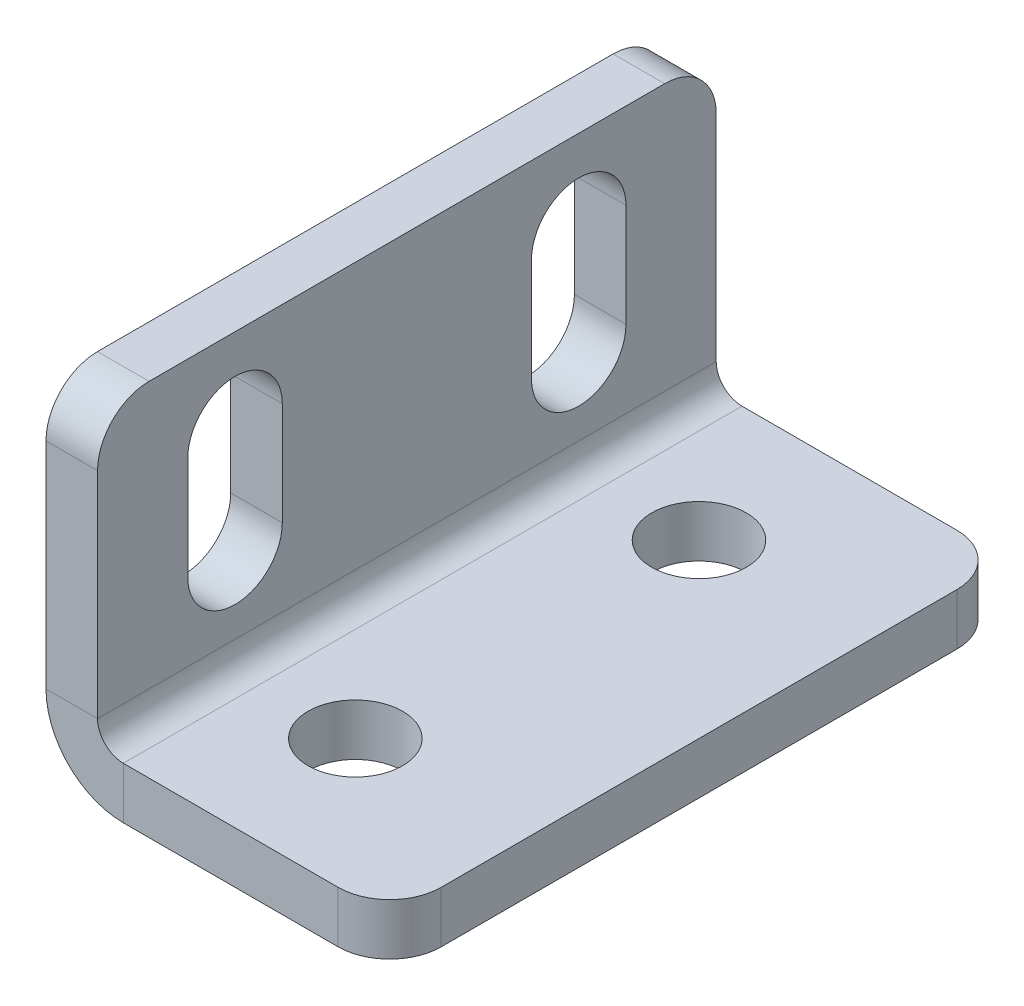
ISO-10303-21;
HEADER;
FILE_DESCRIPTION(('STEP AP214'),'2;1');
FILE_NAME('part.step','',(''),(''),'','','');
FILE_SCHEMA(('AUTOMOTIVE_DESIGN { 1 0 10303 214 1 1 1 1 }'));
ENDSEC;
DATA;
#1=APPLICATION_CONTEXT('core data for automotive mechanical design processes');
#2=APPLICATION_PROTOCOL_DEFINITION('international standard','automotive_design',2000,#1);
#3=PRODUCT_CONTEXT('',#1,'mechanical');
#4=PRODUCT('Part','Part','',(#3));
#5=PRODUCT_RELATED_PRODUCT_CATEGORY('part','',(#4));
#6=PRODUCT_DEFINITION_FORMATION('','',#4);
#7=PRODUCT_DEFINITION_CONTEXT('part definition',#1,'design');
#8=PRODUCT_DEFINITION('design','',#6,#7);
#9=PRODUCT_DEFINITION_SHAPE('','',#8);
#10=(LENGTH_UNIT() NAMED_UNIT(*) SI_UNIT(.MILLI.,.METRE.));
#11=(NAMED_UNIT(*) PLANE_ANGLE_UNIT() SI_UNIT($,.RADIAN.));
#12=(NAMED_UNIT(*) SI_UNIT($,.STERADIAN.) SOLID_ANGLE_UNIT());
#13=UNCERTAINTY_MEASURE_WITH_UNIT(LENGTH_MEASURE(1.E-05),#10,'distance_accuracy_value','');
#14=(GEOMETRIC_REPRESENTATION_CONTEXT(3) GLOBAL_UNCERTAINTY_ASSIGNED_CONTEXT((#13)) GLOBAL_UNIT_ASSIGNED_CONTEXT((#10,
#11,#12)) REPRESENTATION_CONTEXT('',''));
#15=CARTESIAN_POINT('',(0.,0.,0.));
#16=DIRECTION('',(0.,0.,1.));
#17=DIRECTION('',(1.,0.,0.));
#18=AXIS2_PLACEMENT_3D('',#15,#16,#17);
#19=CARTESIAN_POINT('',(0.,0.,18.));
#20=DIRECTION('',(0.,0.,-1.));
#21=DIRECTION('',(0.,-1.,0.));
#22=AXIS2_PLACEMENT_3D('',#19,#20,#21);
#23=PLANE('',#22);
#24=DIRECTION('',(0.,1.,0.));
#25=VECTOR('',#24,1.);
#26=CARTESIAN_POINT('',(3.,0.,18.));
#27=LINE('',#26,#25);
#28=CARTESIAN_POINT('',(3.,17.,18.));
#29=VERTEX_POINT('',#28);
#30=CARTESIAN_POINT('',(3.,4.5,18.));
#31=VERTEX_POINT('',#30);
#32=EDGE_CURVE('E359',#29,#31,#27,.F.);
#33=ORIENTED_EDGE('',*,*,#32,.F.);
#34=DIRECTION('',(1.,0.,0.));
#35=VECTOR('',#34,1.);
#36=CARTESIAN_POINT('',(0.,17.,18.));
#37=LINE('',#36,#35);
#38=CARTESIAN_POINT('',(0.,17.,18.));
#39=VERTEX_POINT('',#38);
#40=EDGE_CURVE('E11',#29,#39,#37,.F.);
#41=ORIENTED_EDGE('',*,*,#40,.T.);
#42=DIRECTION('',(0.,-1.,0.));
#43=VECTOR('',#42,1.);
#44=CARTESIAN_POINT('',(0.,0.,18.));
#45=LINE('',#44,#43);
#46=CARTESIAN_POINT('',(0.,4.5,18.));
#47=VERTEX_POINT('',#46);
#48=EDGE_CURVE('E279',#39,#47,#45,.T.);
#49=ORIENTED_EDGE('',*,*,#48,.T.);
#50=DIRECTION('',(-1.,0.,0.));
#51=VECTOR('',#50,1.);
#52=CARTESIAN_POINT('',(0.,4.5,18.));
#53=LINE('',#52,#51);
#54=EDGE_CURVE('E378',#31,#47,#53,.T.);
#55=ORIENTED_EDGE('',*,*,#54,.F.);
#56=EDGE_LOOP('',(#33,#41,#49,#55));
#57=FACE_BOUND('',#56,.T.);
#58=ADVANCED_FACE('F46',(#57),#23,.F.);
#59=CARTESIAN_POINT('',(0.,20.,-18.));
#60=DIRECTION('',(0.,-1.,0.));
#61=DIRECTION('',(0.,0.,1.));
#62=AXIS2_PLACEMENT_3D('',#59,#60,#61);
#63=PLANE('',#62);
#64=DIRECTION('',(0.,0.,1.));
#65=VECTOR('',#64,1.);
#66=CARTESIAN_POINT('',(3.,20.,-18.));
#67=LINE('',#66,#65);
#68=CARTESIAN_POINT('',(3.,20.,-15.));
#69=VERTEX_POINT('',#68);
#70=CARTESIAN_POINT('',(3.,20.,15.));
#71=VERTEX_POINT('',#70);
#72=EDGE_CURVE('E362',#69,#71,#67,.T.);
#73=ORIENTED_EDGE('',*,*,#72,.F.);
#74=DIRECTION('',(-1.,0.,0.));
#75=VECTOR('',#74,1.);
#76=CARTESIAN_POINT('',(0.,20.,-15.));
#77=LINE('',#76,#75);
#78=CARTESIAN_POINT('',(0.,20.,-15.));
#79=VERTEX_POINT('',#78);
#80=EDGE_CURVE('E412',#69,#79,#77,.T.);
#81=ORIENTED_EDGE('',*,*,#80,.T.);
#82=DIRECTION('',(0.,0.,1.));
#83=VECTOR('',#82,1.);
#84=CARTESIAN_POINT('',(0.,20.,-18.));
#85=LINE('',#84,#83);
#86=CARTESIAN_POINT('',(0.,20.,15.));
#87=VERTEX_POINT('',#86);
#88=EDGE_CURVE('E282',#79,#87,#85,.T.);
#89=ORIENTED_EDGE('',*,*,#88,.T.);
#90=DIRECTION('',(1.,0.,0.));
#91=VECTOR('',#90,1.);
#92=CARTESIAN_POINT('',(0.,20.,15.));
#93=LINE('',#92,#91);
#94=EDGE_CURVE('E409',#87,#71,#93,.T.);
#95=ORIENTED_EDGE('',*,*,#94,.T.);
#96=EDGE_LOOP('',(#73,#81,#89,#95));
#97=FACE_BOUND('',#96,.T.);
#98=ADVANCED_FACE('F440',(#97),#63,.F.);
#99=CARTESIAN_POINT('',(0.,0.,-18.));
#100=DIRECTION('',(0.,0.,-1.));
#101=DIRECTION('',(0.,-1.,0.));
#102=AXIS2_PLACEMENT_3D('',#99,#100,#101);
#103=PLANE('',#102);
#104=DIRECTION('',(0.,-1.,0.));
#105=VECTOR('',#104,1.);
#106=CARTESIAN_POINT('',(0.,0.,-18.));
#107=LINE('',#106,#105);
#108=CARTESIAN_POINT('',(0.,17.,-18.));
#109=VERTEX_POINT('',#108);
#110=CARTESIAN_POINT('',(0.,4.5,-18.));
#111=VERTEX_POINT('',#110);
#112=EDGE_CURVE('E287',#109,#111,#107,.T.);
#113=ORIENTED_EDGE('',*,*,#112,.F.);
#114=DIRECTION('',(1.,0.,0.));
#115=VECTOR('',#114,1.);
#116=CARTESIAN_POINT('',(0.,17.,-18.));
#117=LINE('',#116,#115);
#118=CARTESIAN_POINT('',(3.,17.,-18.));
#119=VERTEX_POINT('',#118);
#120=EDGE_CURVE('E422',#109,#119,#117,.T.);
#121=ORIENTED_EDGE('',*,*,#120,.T.);
#122=DIRECTION('',(0.,1.,0.));
#123=VECTOR('',#122,1.);
#124=CARTESIAN_POINT('',(3.,0.,-18.));
#125=LINE('',#124,#123);
#126=CARTESIAN_POINT('',(3.,4.5,-18.));
#127=VERTEX_POINT('',#126);
#128=EDGE_CURVE('E340',#119,#127,#125,.F.);
#129=ORIENTED_EDGE('',*,*,#128,.T.);
#130=DIRECTION('',(-1.,0.,0.));
#131=VECTOR('',#130,1.);
#132=CARTESIAN_POINT('',(0.,4.5,-18.));
#133=LINE('',#132,#131);
#134=EDGE_CURVE('E374',#127,#111,#133,.T.);
#135=ORIENTED_EDGE('',*,*,#134,.T.);
#136=EDGE_LOOP('',(#113,#121,#129,#135));
#137=FACE_BOUND('',#136,.T.);
#138=ADVANCED_FACE('F447',(#137),#103,.T.);
#139=CARTESIAN_POINT('',(4.5,4.5,-18.));
#140=DIRECTION('',(0.,0.,1.));
#141=DIRECTION('',(1.,0.,0.));
#142=AXIS2_PLACEMENT_3D('',#139,#140,#141);
#143=PLANE('',#142);
#144=ORIENTED_EDGE('',*,*,#134,.F.);
#145=CARTESIAN_POINT('',(4.5,4.5,-18.));
#146=DIRECTION('',(0.,0.,1.));
#147=DIRECTION('',(1.,0.,0.));
#148=AXIS2_PLACEMENT_3D('',#145,#146,#147);
#149=CIRCLE('',#148,1.5);
#150=CARTESIAN_POINT('',(4.5,3.,-18.));
#151=VERTEX_POINT('',#150);
#152=EDGE_CURVE('E355',#127,#151,#149,.T.);
#153=ORIENTED_EDGE('',*,*,#152,.T.);
#154=DIRECTION('',(0.,-1.,0.));
#155=VECTOR('',#154,1.);
#156=CARTESIAN_POINT('',(4.5,0.,-18.));
#157=LINE('',#156,#155);
#158=CARTESIAN_POINT('',(4.5,0.,-18.));
#159=VERTEX_POINT('',#158);
#160=EDGE_CURVE('E371',#151,#159,#157,.T.);
#161=ORIENTED_EDGE('',*,*,#160,.T.);
#162=CARTESIAN_POINT('',(4.5,4.5,-18.));
#163=DIRECTION('',(0.,0.,-1.));
#164=DIRECTION('',(-1.,0.,0.));
#165=AXIS2_PLACEMENT_3D('',#162,#163,#164);
#166=CIRCLE('',#165,4.5);
#167=EDGE_CURVE('E283',#111,#159,#166,.F.);
#168=ORIENTED_EDGE('',*,*,#167,.F.);
#169=EDGE_LOOP('',(#144,#153,#161,#168));
#170=FACE_BOUND('',#169,.T.);
#171=ADVANCED_FACE('F452',(#170),#143,.F.);
#172=CARTESIAN_POINT('',(20.,0.,-18.));
#173=DIRECTION('',(0.,0.,-1.));
#174=DIRECTION('',(1.,0.,0.));
#175=AXIS2_PLACEMENT_3D('',#172,#173,#174);
#176=PLANE('',#175);
#177=DIRECTION('',(1.,0.,0.));
#178=VECTOR('',#177,1.);
#179=CARTESIAN_POINT('',(20.,3.,-18.));
#180=LINE('',#179,#178);
#181=CARTESIAN_POINT('',(17.,3.,-18.));
#182=VERTEX_POINT('',#181);
#183=EDGE_CURVE('E334',#151,#182,#180,.T.);
#184=ORIENTED_EDGE('',*,*,#183,.T.);
#185=DIRECTION('',(0.,-1.,0.));
#186=VECTOR('',#185,1.);
#187=CARTESIAN_POINT('',(17.,0.,-18.));
#188=LINE('',#187,#186);
#189=CARTESIAN_POINT('',(17.,0.,-18.));
#190=VERTEX_POINT('',#189);
#191=EDGE_CURVE('E382',#182,#190,#188,.T.);
#192=ORIENTED_EDGE('',*,*,#191,.T.);
#193=DIRECTION('',(1.,0.,0.));
#194=VECTOR('',#193,1.);
#195=CARTESIAN_POINT('',(20.,0.,-18.));
#196=LINE('',#195,#194);
#197=EDGE_CURVE('E306',#159,#190,#196,.T.);
#198=ORIENTED_EDGE('',*,*,#197,.F.);
#199=ORIENTED_EDGE('',*,*,#160,.F.);
#200=EDGE_LOOP('',(#184,#192,#198,#199));
#201=FACE_BOUND('',#200,.T.);
#202=ADVANCED_FACE('F494',(#201),#176,.T.);
#203=CARTESIAN_POINT('',(20.,0.,-18.));
#204=DIRECTION('',(1.,0.,0.));
#205=DIRECTION('',(0.,0.,1.));
#206=AXIS2_PLACEMENT_3D('',#203,#204,#205);
#207=PLANE('',#206);
#208=DIRECTION('',(0.,0.,1.));
#209=VECTOR('',#208,1.);
#210=CARTESIAN_POINT('',(20.,0.,-18.));
#211=LINE('',#210,#209);
#212=CARTESIAN_POINT('',(20.,0.,-15.));
#213=VERTEX_POINT('',#212);
#214=CARTESIAN_POINT('',(20.,0.,15.));
#215=VERTEX_POINT('',#214);
#216=EDGE_CURVE('E298',#213,#215,#211,.T.);
#217=ORIENTED_EDGE('',*,*,#216,.F.);
#218=DIRECTION('',(0.,-1.,0.));
#219=VECTOR('',#218,1.);
#220=CARTESIAN_POINT('',(20.,0.,-15.));
#221=LINE('',#220,#219);
#222=CARTESIAN_POINT('',(20.,3.,-15.));
#223=VERTEX_POINT('',#222);
#224=EDGE_CURVE('E397',#213,#223,#221,.F.);
#225=ORIENTED_EDGE('',*,*,#224,.T.);
#226=DIRECTION('',(0.,0.,1.));
#227=VECTOR('',#226,1.);
#228=CARTESIAN_POINT('',(20.,3.,-18.));
#229=LINE('',#228,#227);
#230=CARTESIAN_POINT('',(20.,3.,15.));
#231=VERTEX_POINT('',#230);
#232=EDGE_CURVE('E344',#223,#231,#229,.T.);
#233=ORIENTED_EDGE('',*,*,#232,.T.);
#234=DIRECTION('',(0.,1.,0.));
#235=VECTOR('',#234,1.);
#236=CARTESIAN_POINT('',(20.,0.,15.));
#237=LINE('',#236,#235);
#238=EDGE_CURVE('E394',#231,#215,#237,.F.);
#239=ORIENTED_EDGE('',*,*,#238,.T.);
#240=EDGE_LOOP('',(#217,#225,#233,#239));
#241=FACE_BOUND('',#240,.T.);
#242=ADVANCED_FACE('F485',(#241),#207,.T.);
#243=CARTESIAN_POINT('',(20.,0.,18.));
#244=DIRECTION('',(0.,0.,-1.));
#245=DIRECTION('',(1.,0.,0.));
#246=AXIS2_PLACEMENT_3D('',#243,#244,#245);
#247=PLANE('',#246);
#248=DIRECTION('',(1.,0.,0.));
#249=VECTOR('',#248,1.);
#250=CARTESIAN_POINT('',(20.,0.,18.));
#251=LINE('',#250,#249);
#252=CARTESIAN_POINT('',(4.5,0.,18.));
#253=VERTEX_POINT('',#252);
#254=CARTESIAN_POINT('',(17.,0.,18.));
#255=VERTEX_POINT('',#254);
#256=EDGE_CURVE('E302',#253,#255,#251,.T.);
#257=ORIENTED_EDGE('',*,*,#256,.T.);
#258=DIRECTION('',(0.,-1.,0.));
#259=VECTOR('',#258,1.);
#260=CARTESIAN_POINT('',(17.,0.,18.));
#261=LINE('',#260,#259);
#262=CARTESIAN_POINT('',(17.,3.,18.));
#263=VERTEX_POINT('',#262);
#264=EDGE_CURVE('E406',#255,#263,#261,.F.);
#265=ORIENTED_EDGE('',*,*,#264,.T.);
#266=DIRECTION('',(1.,0.,0.));
#267=VECTOR('',#266,1.);
#268=CARTESIAN_POINT('',(20.,3.,18.));
#269=LINE('',#268,#267);
#270=CARTESIAN_POINT('',(4.5,3.,18.));
#271=VERTEX_POINT('',#270);
#272=EDGE_CURVE('E345',#271,#263,#269,.T.);
#273=ORIENTED_EDGE('',*,*,#272,.F.);
#274=DIRECTION('',(0.,-1.,0.));
#275=VECTOR('',#274,1.);
#276=CARTESIAN_POINT('',(4.5,0.,18.));
#277=LINE('',#276,#275);
#278=EDGE_CURVE('E318',#271,#253,#277,.T.);
#279=ORIENTED_EDGE('',*,*,#278,.T.);
#280=EDGE_LOOP('',(#257,#265,#273,#279));
#281=FACE_BOUND('',#280,.T.);
#282=ADVANCED_FACE('F472',(#281),#247,.F.);
#283=CARTESIAN_POINT('',(10.,0.,-10.));
#284=DIRECTION('',(0.,-1.,0.));
#285=DIRECTION('',(1.,0.,0.));
#286=AXIS2_PLACEMENT_3D('',#283,#284,#285);
#287=CYLINDRICAL_SURFACE('',#286,2.75);
#288=CARTESIAN_POINT('',(10.,0.,-10.));
#289=DIRECTION('',(0.,-1.,0.));
#290=DIRECTION('',(0.,0.,-1.));
#291=AXIS2_PLACEMENT_3D('',#288,#289,#290);
#292=CIRCLE('',#291,2.75);
#293=CARTESIAN_POINT('',(10.,0.,-12.75));
#294=VERTEX_POINT('',#293);
#295=EDGE_CURVE('E290',#294,#294,#292,.T.);
#296=ORIENTED_EDGE('',*,*,#295,.T.);
#297=EDGE_LOOP('',(#296));
#298=FACE_BOUND('',#297,.T.);
#299=CARTESIAN_POINT('',(10.,3.,-10.));
#300=DIRECTION('',(0.,-1.,0.));
#301=DIRECTION('',(0.,0.,-1.));
#302=AXIS2_PLACEMENT_3D('',#299,#300,#301);
#303=CIRCLE('',#302,2.75);
#304=CARTESIAN_POINT('',(10.,3.,-12.75));
#305=VERTEX_POINT('',#304);
#306=EDGE_CURVE('E335',#305,#305,#303,.T.);
#307=ORIENTED_EDGE('',*,*,#306,.F.);
#308=EDGE_LOOP('',(#307));
#309=FACE_BOUND('',#308,.T.);
#310=ADVANCED_FACE('F568',(#298,#309),#287,.F.);
#311=CARTESIAN_POINT('',(10.,0.,10.));
#312=DIRECTION('',(0.,-1.,0.));
#313=DIRECTION('',(1.,0.,0.));
#314=AXIS2_PLACEMENT_3D('',#311,#312,#313);
#315=CYLINDRICAL_SURFACE('',#314,2.75);
#316=CARTESIAN_POINT('',(10.,0.,10.));
#317=DIRECTION('',(0.,-1.,0.));
#318=DIRECTION('',(0.,0.,-1.));
#319=AXIS2_PLACEMENT_3D('',#316,#317,#318);
#320=CIRCLE('',#319,2.75);
#321=CARTESIAN_POINT('',(10.,0.,7.25));
#322=VERTEX_POINT('',#321);
#323=EDGE_CURVE('E294',#322,#322,#320,.T.);
#324=ORIENTED_EDGE('',*,*,#323,.T.);
#325=EDGE_LOOP('',(#324));
#326=FACE_BOUND('',#325,.T.);
#327=CARTESIAN_POINT('',(10.,3.,10.));
#328=DIRECTION('',(0.,-1.,0.));
#329=DIRECTION('',(0.,0.,-1.));
#330=AXIS2_PLACEMENT_3D('',#327,#328,#329);
#331=CIRCLE('',#330,2.75);
#332=CARTESIAN_POINT('',(10.,3.,7.25));
#333=VERTEX_POINT('',#332);
#334=EDGE_CURVE('E339',#333,#333,#331,.T.);
#335=ORIENTED_EDGE('',*,*,#334,.F.);
#336=EDGE_LOOP('',(#335));
#337=FACE_BOUND('',#336,.T.);
#338=ADVANCED_FACE('F513',(#326,#337),#315,.F.);
#339=CARTESIAN_POINT('',(4.5,4.5,18.));
#340=DIRECTION('',(0.,0.,-1.));
#341=DIRECTION('',(-1.,0.,0.));
#342=AXIS2_PLACEMENT_3D('',#339,#340,#341);
#343=PLANE('',#342);
#344=CARTESIAN_POINT('',(4.5,4.5,18.));
#345=DIRECTION('',(0.,0.,1.));
#346=DIRECTION('',(1.,0.,0.));
#347=AXIS2_PLACEMENT_3D('',#344,#345,#346);
#348=CIRCLE('',#347,1.5);
#349=EDGE_CURVE('E278',#271,#31,#348,.F.);
#350=ORIENTED_EDGE('',*,*,#349,.T.);
#351=ORIENTED_EDGE('',*,*,#54,.T.);
#352=CARTESIAN_POINT('',(4.5,4.5,18.));
#353=DIRECTION('',(0.,0.,1.));
#354=DIRECTION('',(1.,0.,0.));
#355=AXIS2_PLACEMENT_3D('',#352,#353,#354);
#356=CIRCLE('',#355,4.5);
#357=EDGE_CURVE('E319',#253,#47,#356,.F.);
#358=ORIENTED_EDGE('',*,*,#357,.F.);
#359=ORIENTED_EDGE('',*,*,#278,.F.);
#360=EDGE_LOOP('',(#350,#351,#358,#359));
#361=FACE_BOUND('',#360,.T.);
#362=ADVANCED_FACE('F464',(#361),#343,.F.);
#363=CARTESIAN_POINT('',(20.,0.,-18.));
#364=DIRECTION('',(0.,-1.,0.));
#365=DIRECTION('',(1.,0.,0.));
#366=AXIS2_PLACEMENT_3D('',#363,#364,#365);
#367=PLANE('',#366);
#368=ORIENTED_EDGE('',*,*,#295,.F.);
#369=EDGE_LOOP('',(#368));
#370=FACE_BOUND('',#369,.T.);
#371=ORIENTED_EDGE('',*,*,#323,.F.);
#372=EDGE_LOOP('',(#371));
#373=FACE_BOUND('',#372,.T.);
#374=ORIENTED_EDGE('',*,*,#197,.T.);
#375=CARTESIAN_POINT('',(17.,0.,-15.));
#376=DIRECTION('',(0.,-1.,0.));
#377=DIRECTION('',(1.,0.,0.));
#378=AXIS2_PLACEMENT_3D('',#375,#376,#377);
#379=CIRCLE('',#378,3.);
#380=EDGE_CURVE('E391',#190,#213,#379,.T.);
#381=ORIENTED_EDGE('',*,*,#380,.T.);
#382=ORIENTED_EDGE('',*,*,#216,.T.);
#383=CARTESIAN_POINT('',(17.,0.,15.));
#384=DIRECTION('',(0.,-1.,0.));
#385=DIRECTION('',(1.,0.,0.));
#386=AXIS2_PLACEMENT_3D('',#383,#384,#385);
#387=CIRCLE('',#386,3.);
#388=EDGE_CURVE('E388',#215,#255,#387,.T.);
#389=ORIENTED_EDGE('',*,*,#388,.T.);
#390=ORIENTED_EDGE('',*,*,#256,.F.);
#391=DIRECTION('',(0.,0.,1.));
#392=VECTOR('',#391,1.);
#393=CARTESIAN_POINT('',(4.5,0.,-18.));
#394=LINE('',#393,#392);
#395=EDGE_CURVE('E314',#253,#159,#394,.F.);
#396=ORIENTED_EDGE('',*,*,#395,.T.);
#397=EDGE_LOOP('',(#374,#381,#382,#389,#390,#396));
#398=FACE_BOUND('',#397,.T.);
#399=ADVANCED_FACE('F488',(#370,#373,#398),#367,.T.);
#400=CARTESIAN_POINT('',(0.,0.,-18.));
#401=DIRECTION('',(-1.,0.,0.));
#402=DIRECTION('',(0.,0.,1.));
#403=AXIS2_PLACEMENT_3D('',#400,#401,#402);
#404=PLANE('',#403);
#405=DIRECTION('',(0.,1.,0.));
#406=VECTOR('',#405,1.);
#407=CARTESIAN_POINT('',(0.,15.,7.25000000000001));
#408=LINE('',#407,#406);
#409=CARTESIAN_POINT('',(0.,9.,7.25000000000001));
#410=VERTEX_POINT('',#409);
#411=CARTESIAN_POINT('',(0.,15.,7.25000000000001));
#412=VERTEX_POINT('',#411);
#413=EDGE_CURVE('E194',#410,#412,#408,.T.);
#414=ORIENTED_EDGE('',*,*,#413,.T.);
#415=CARTESIAN_POINT('',(0.,15.,10.));
#416=DIRECTION('',(1.,0.,0.));
#417=DIRECTION('',(0.,0.,-1.));
#418=AXIS2_PLACEMENT_3D('',#415,#416,#417);
#419=CIRCLE('',#418,2.74999999999999);
#420=CARTESIAN_POINT('',(0.,15.,12.75));
#421=VERTEX_POINT('',#420);
#422=EDGE_CURVE('E188',#412,#421,#419,.T.);
#423=ORIENTED_EDGE('',*,*,#422,.T.);
#424=DIRECTION('',(0.,-1.,0.));
#425=VECTOR('',#424,1.);
#426=CARTESIAN_POINT('',(0.,15.,12.75));
#427=LINE('',#426,#425);
#428=CARTESIAN_POINT('',(0.,9.,12.75));
#429=VERTEX_POINT('',#428);
#430=EDGE_CURVE('E197',#421,#429,#427,.T.);
#431=ORIENTED_EDGE('',*,*,#430,.T.);
#432=CARTESIAN_POINT('',(0.,9.,10.));
#433=DIRECTION('',(1.,0.,0.));
#434=DIRECTION('',(0.,0.,-1.));
#435=AXIS2_PLACEMENT_3D('',#432,#433,#434);
#436=CIRCLE('',#435,2.75);
#437=EDGE_CURVE('E267',#429,#410,#436,.T.);
#438=ORIENTED_EDGE('',*,*,#437,.T.);
#439=EDGE_LOOP('',(#414,#423,#431,#438));
#440=FACE_BOUND('',#439,.T.);
#441=DIRECTION('',(0.,1.,0.));
#442=VECTOR('',#441,1.);
#443=CARTESIAN_POINT('',(0.,15.,-12.75));
#444=LINE('',#443,#442);
#445=CARTESIAN_POINT('',(0.,9.,-12.75));
#446=VERTEX_POINT('',#445);
#447=CARTESIAN_POINT('',(0.,15.,-12.75));
#448=VERTEX_POINT('',#447);
#449=EDGE_CURVE('E241',#446,#448,#444,.T.);
#450=ORIENTED_EDGE('',*,*,#449,.T.);
#451=CARTESIAN_POINT('',(0.,15.,-10.));
#452=DIRECTION('',(1.,0.,0.));
#453=DIRECTION('',(0.,0.,-1.));
#454=AXIS2_PLACEMENT_3D('',#451,#452,#453);
#455=CIRCLE('',#454,2.74999999999999);
#456=CARTESIAN_POINT('',(0.,15.,-7.25000000000001));
#457=VERTEX_POINT('',#456);
#458=EDGE_CURVE('E232',#448,#457,#455,.T.);
#459=ORIENTED_EDGE('',*,*,#458,.T.);
#460=DIRECTION('',(0.,-1.,0.));
#461=VECTOR('',#460,1.);
#462=CARTESIAN_POINT('',(0.,15.,-7.25000000000001));
#463=LINE('',#462,#461);
#464=CARTESIAN_POINT('',(0.,9.,-7.25000000000001));
#465=VERTEX_POINT('',#464);
#466=EDGE_CURVE('E236',#457,#465,#463,.T.);
#467=ORIENTED_EDGE('',*,*,#466,.T.);
#468=CARTESIAN_POINT('',(0.,9.,-10.));
#469=DIRECTION('',(1.,0.,0.));
#470=DIRECTION('',(0.,0.,-1.));
#471=AXIS2_PLACEMENT_3D('',#468,#469,#470);
#472=CIRCLE('',#471,2.75);
#473=EDGE_CURVE('E274',#465,#446,#472,.T.);
#474=ORIENTED_EDGE('',*,*,#473,.T.);
#475=EDGE_LOOP('',(#450,#459,#467,#474));
#476=FACE_BOUND('',#475,.T.);
#477=ORIENTED_EDGE('',*,*,#88,.F.);
#478=CARTESIAN_POINT('',(0.,17.,-15.));
#479=DIRECTION('',(-1.,0.,0.));
#480=DIRECTION('',(0.,0.,1.));
#481=AXIS2_PLACEMENT_3D('',#478,#479,#480);
#482=CIRCLE('',#481,3.);
#483=EDGE_CURVE('E419',#79,#109,#482,.T.);
#484=ORIENTED_EDGE('',*,*,#483,.T.);
#485=ORIENTED_EDGE('',*,*,#112,.T.);
#486=DIRECTION('',(0.,0.,1.));
#487=VECTOR('',#486,1.);
#488=CARTESIAN_POINT('',(0.,4.5,-18.));
#489=LINE('',#488,#487);
#490=EDGE_CURVE('E310',#111,#47,#489,.T.);
#491=ORIENTED_EDGE('',*,*,#490,.T.);
#492=ORIENTED_EDGE('',*,*,#48,.F.);
#493=CARTESIAN_POINT('',(0.,17.,15.));
#494=DIRECTION('',(-1.,0.,0.));
#495=DIRECTION('',(0.,0.,1.));
#496=AXIS2_PLACEMENT_3D('',#493,#494,#495);
#497=CIRCLE('',#496,3.);
#498=EDGE_CURVE('E416',#39,#87,#497,.T.);
#499=ORIENTED_EDGE('',*,*,#498,.T.);
#500=EDGE_LOOP('',(#477,#484,#485,#491,#492,#499));
#501=FACE_BOUND('',#500,.T.);
#502=ADVANCED_FACE('F204',(#440,#476,#501),#404,.T.);
#503=CARTESIAN_POINT('',(4.5,4.5,-18.));
#504=DIRECTION('',(0.,0.,1.));
#505=DIRECTION('',(1.,0.,0.));
#506=AXIS2_PLACEMENT_3D('',#503,#504,#505);
#507=CYLINDRICAL_SURFACE('',#506,4.5);
#508=ORIENTED_EDGE('',*,*,#167,.T.);
#509=ORIENTED_EDGE('',*,*,#395,.F.);
#510=ORIENTED_EDGE('',*,*,#357,.T.);
#511=ORIENTED_EDGE('',*,*,#490,.F.);
#512=EDGE_LOOP('',(#508,#509,#510,#511));
#513=FACE_BOUND('',#512,.T.);
#514=ADVANCED_FACE('F456',(#513),#507,.T.);
#515=CARTESIAN_POINT('',(20.,3.,-18.));
#516=DIRECTION('',(0.,-1.,0.));
#517=DIRECTION('',(1.,0.,0.));
#518=AXIS2_PLACEMENT_3D('',#515,#516,#517);
#519=PLANE('',#518);
#520=ORIENTED_EDGE('',*,*,#306,.T.);
#521=EDGE_LOOP('',(#520));
#522=FACE_BOUND('',#521,.T.);
#523=ORIENTED_EDGE('',*,*,#334,.T.);
#524=EDGE_LOOP('',(#523));
#525=FACE_BOUND('',#524,.T.);
#526=ORIENTED_EDGE('',*,*,#232,.F.);
#527=CARTESIAN_POINT('',(17.,3.,-15.));
#528=DIRECTION('',(0.,-1.,0.));
#529=DIRECTION('',(1.,0.,0.));
#530=AXIS2_PLACEMENT_3D('',#527,#528,#529);
#531=CIRCLE('',#530,3.);
#532=EDGE_CURVE('E403',#223,#182,#531,.F.);
#533=ORIENTED_EDGE('',*,*,#532,.T.);
#534=ORIENTED_EDGE('',*,*,#183,.F.);
#535=DIRECTION('',(0.,0.,1.));
#536=VECTOR('',#535,1.);
#537=CARTESIAN_POINT('',(4.5,3.,-18.));
#538=LINE('',#537,#536);
#539=EDGE_CURVE('E323',#271,#151,#538,.F.);
#540=ORIENTED_EDGE('',*,*,#539,.F.);
#541=ORIENTED_EDGE('',*,*,#272,.T.);
#542=CARTESIAN_POINT('',(17.,3.,15.));
#543=DIRECTION('',(0.,-1.,0.));
#544=DIRECTION('',(1.,0.,0.));
#545=AXIS2_PLACEMENT_3D('',#542,#543,#544);
#546=CIRCLE('',#545,3.);
#547=EDGE_CURVE('E400',#263,#231,#546,.F.);
#548=ORIENTED_EDGE('',*,*,#547,.T.);
#549=EDGE_LOOP('',(#526,#533,#534,#540,#541,#548));
#550=FACE_BOUND('',#549,.T.);
#551=ADVANCED_FACE('F478',(#522,#525,#550),#519,.F.);
#552=CARTESIAN_POINT('',(3.,0.,-18.));
#553=DIRECTION('',(-1.,0.,0.));
#554=DIRECTION('',(0.,0.,1.));
#555=AXIS2_PLACEMENT_3D('',#552,#553,#554);
#556=PLANE('',#555);
#557=CARTESIAN_POINT('',(3.,15.,10.));
#558=DIRECTION('',(1.,0.,0.));
#559=DIRECTION('',(0.,0.,-1.));
#560=AXIS2_PLACEMENT_3D('',#557,#558,#559);
#561=CIRCLE('',#560,2.74999999999999);
#562=CARTESIAN_POINT('',(3.,15.,7.25000000000001));
#563=VERTEX_POINT('',#562);
#564=CARTESIAN_POINT('',(3.,15.,12.75));
#565=VERTEX_POINT('',#564);
#566=EDGE_CURVE('E191',#563,#565,#561,.T.);
#567=ORIENTED_EDGE('',*,*,#566,.F.);
#568=DIRECTION('',(0.,1.,0.));
#569=VECTOR('',#568,1.);
#570=CARTESIAN_POINT('',(3.,15.,7.25000000000001));
#571=LINE('',#570,#569);
#572=CARTESIAN_POINT('',(3.,9.,7.25000000000001));
#573=VERTEX_POINT('',#572);
#574=EDGE_CURVE('E207',#573,#563,#571,.T.);
#575=ORIENTED_EDGE('',*,*,#574,.F.);
#576=CARTESIAN_POINT('',(3.,9.,10.));
#577=DIRECTION('',(1.,0.,0.));
#578=DIRECTION('',(0.,0.,-1.));
#579=AXIS2_PLACEMENT_3D('',#576,#577,#578);
#580=CIRCLE('',#579,2.74999999999999);
#581=CARTESIAN_POINT('',(3.,9.,12.75));
#582=VERTEX_POINT('',#581);
#583=EDGE_CURVE('E226',#582,#573,#580,.T.);
#584=ORIENTED_EDGE('',*,*,#583,.F.);
#585=DIRECTION('',(0.,-1.,0.));
#586=VECTOR('',#585,1.);
#587=CARTESIAN_POINT('',(3.,15.,12.75));
#588=LINE('',#587,#586);
#589=EDGE_CURVE('E70',#565,#582,#588,.T.);
#590=ORIENTED_EDGE('',*,*,#589,.F.);
#591=EDGE_LOOP('',(#567,#575,#584,#590));
#592=FACE_BOUND('',#591,.T.);
#593=CARTESIAN_POINT('',(3.,15.,-10.));
#594=DIRECTION('',(1.,0.,0.));
#595=DIRECTION('',(0.,0.,-1.));
#596=AXIS2_PLACEMENT_3D('',#593,#594,#595);
#597=CIRCLE('',#596,2.74999999999999);
#598=CARTESIAN_POINT('',(3.,15.,-12.75));
#599=VERTEX_POINT('',#598);
#600=CARTESIAN_POINT('',(3.,15.,-7.25000000000001));
#601=VERTEX_POINT('',#600);
#602=EDGE_CURVE('E246',#599,#601,#597,.T.);
#603=ORIENTED_EDGE('',*,*,#602,.F.);
#604=DIRECTION('',(0.,1.,0.));
#605=VECTOR('',#604,1.);
#606=CARTESIAN_POINT('',(3.,15.,-12.75));
#607=LINE('',#606,#605);
#608=CARTESIAN_POINT('',(3.,9.,-12.75));
#609=VERTEX_POINT('',#608);
#610=EDGE_CURVE('E237',#609,#599,#607,.T.);
#611=ORIENTED_EDGE('',*,*,#610,.F.);
#612=CARTESIAN_POINT('',(3.,9.,-10.));
#613=DIRECTION('',(1.,0.,0.));
#614=DIRECTION('',(0.,0.,-1.));
#615=AXIS2_PLACEMENT_3D('',#612,#613,#614);
#616=CIRCLE('',#615,2.74999999999999);
#617=CARTESIAN_POINT('',(3.,9.,-7.25000000000001));
#618=VERTEX_POINT('',#617);
#619=EDGE_CURVE('E270',#618,#609,#616,.T.);
#620=ORIENTED_EDGE('',*,*,#619,.F.);
#621=DIRECTION('',(0.,-1.,0.));
#622=VECTOR('',#621,1.);
#623=CARTESIAN_POINT('',(3.,15.,-7.25000000000001));
#624=LINE('',#623,#622);
#625=EDGE_CURVE('E62',#601,#618,#624,.T.);
#626=ORIENTED_EDGE('',*,*,#625,.F.);
#627=EDGE_LOOP('',(#603,#611,#620,#626));
#628=FACE_BOUND('',#627,.T.);
#629=ORIENTED_EDGE('',*,*,#128,.F.);
#630=CARTESIAN_POINT('',(3.,17.,-15.));
#631=DIRECTION('',(-1.,0.,0.));
#632=DIRECTION('',(0.,0.,1.));
#633=AXIS2_PLACEMENT_3D('',#630,#631,#632);
#634=CIRCLE('',#633,3.);
#635=EDGE_CURVE('E55',#119,#69,#634,.F.);
#636=ORIENTED_EDGE('',*,*,#635,.T.);
#637=ORIENTED_EDGE('',*,*,#72,.T.);
#638=CARTESIAN_POINT('',(3.,17.,15.));
#639=DIRECTION('',(-1.,0.,0.));
#640=DIRECTION('',(0.,0.,1.));
#641=AXIS2_PLACEMENT_3D('',#638,#639,#640);
#642=CIRCLE('',#641,3.);
#643=EDGE_CURVE('E425',#71,#29,#642,.F.);
#644=ORIENTED_EDGE('',*,*,#643,.T.);
#645=ORIENTED_EDGE('',*,*,#32,.T.);
#646=DIRECTION('',(0.,0.,1.));
#647=VECTOR('',#646,1.);
#648=CARTESIAN_POINT('',(3.,4.5,-18.));
#649=LINE('',#648,#647);
#650=EDGE_CURVE('E330',#127,#31,#649,.T.);
#651=ORIENTED_EDGE('',*,*,#650,.F.);
#652=EDGE_LOOP('',(#629,#636,#637,#644,#645,#651));
#653=FACE_BOUND('',#652,.T.);
#654=ADVANCED_FACE('F433',(#592,#628,#653),#556,.F.);
#655=CARTESIAN_POINT('',(4.5,4.5,-18.));
#656=DIRECTION('',(0.,0.,1.));
#657=DIRECTION('',(1.,0.,0.));
#658=AXIS2_PLACEMENT_3D('',#655,#656,#657);
#659=CYLINDRICAL_SURFACE('',#658,1.5);
#660=ORIENTED_EDGE('',*,*,#152,.F.);
#661=ORIENTED_EDGE('',*,*,#650,.T.);
#662=ORIENTED_EDGE('',*,*,#349,.F.);
#663=ORIENTED_EDGE('',*,*,#539,.T.);
#664=EDGE_LOOP('',(#660,#661,#662,#663));
#665=FACE_BOUND('',#664,.T.);
#666=ADVANCED_FACE('F470',(#665),#659,.F.);
#667=CARTESIAN_POINT('',(3.,9.,-10.));
#668=DIRECTION('',(1.,0.,0.));
#669=DIRECTION('',(0.,0.,-1.));
#670=AXIS2_PLACEMENT_3D('',#667,#668,#669);
#671=CYLINDRICAL_SURFACE('',#670,2.74999999999999);
#672=ORIENTED_EDGE('',*,*,#619,.T.);
#673=DIRECTION('',(1.,0.,0.));
#674=VECTOR('',#673,1.);
#675=CARTESIAN_POINT('',(0.,9.,-12.75));
#676=LINE('',#675,#674);
#677=EDGE_CURVE('E257',#446,#609,#676,.T.);
#678=ORIENTED_EDGE('',*,*,#677,.F.);
#679=ORIENTED_EDGE('',*,*,#473,.F.);
#680=DIRECTION('',(1.,0.,0.));
#681=VECTOR('',#680,1.);
#682=CARTESIAN_POINT('',(0.,9.,-7.25000000000001));
#683=LINE('',#682,#681);
#684=EDGE_CURVE('E260',#465,#618,#683,.T.);
#685=ORIENTED_EDGE('',*,*,#684,.T.);
#686=EDGE_LOOP('',(#672,#678,#679,#685));
#687=FACE_BOUND('',#686,.T.);
#688=ADVANCED_FACE('F548',(#687),#671,.F.);
#689=CARTESIAN_POINT('',(3.,9.,10.));
#690=DIRECTION('',(1.,0.,0.));
#691=DIRECTION('',(0.,0.,-1.));
#692=AXIS2_PLACEMENT_3D('',#689,#690,#691);
#693=CYLINDRICAL_SURFACE('',#692,2.74999999999999);
#694=ORIENTED_EDGE('',*,*,#583,.T.);
#695=DIRECTION('',(1.,0.,0.));
#696=VECTOR('',#695,1.);
#697=CARTESIAN_POINT('',(0.,9.,7.25000000000001));
#698=LINE('',#697,#696);
#699=EDGE_CURVE('E227',#410,#573,#698,.T.);
#700=ORIENTED_EDGE('',*,*,#699,.F.);
#701=ORIENTED_EDGE('',*,*,#437,.F.);
#702=DIRECTION('',(1.,0.,0.));
#703=VECTOR('',#702,1.);
#704=CARTESIAN_POINT('',(0.,9.,12.75));
#705=LINE('',#704,#703);
#706=EDGE_CURVE('E193',#429,#582,#705,.T.);
#707=ORIENTED_EDGE('',*,*,#706,.T.);
#708=EDGE_LOOP('',(#694,#700,#701,#707));
#709=FACE_BOUND('',#708,.T.);
#710=ADVANCED_FACE('F516',(#709),#693,.F.);
#711=CARTESIAN_POINT('',(17.,0.,-15.));
#712=DIRECTION('',(0.,-1.,0.));
#713=DIRECTION('',(1.,0.,0.));
#714=AXIS2_PLACEMENT_3D('',#711,#712,#713);
#715=CYLINDRICAL_SURFACE('',#714,3.);
#716=ORIENTED_EDGE('',*,*,#532,.F.);
#717=ORIENTED_EDGE('',*,*,#224,.F.);
#718=ORIENTED_EDGE('',*,*,#380,.F.);
#719=ORIENTED_EDGE('',*,*,#191,.F.);
#720=EDGE_LOOP('',(#716,#717,#718,#719));
#721=FACE_BOUND('',#720,.T.);
#722=ADVANCED_FACE('F492',(#721),#715,.T.);
#723=CARTESIAN_POINT('',(17.,0.,15.));
#724=DIRECTION('',(0.,1.,0.));
#725=DIRECTION('',(-1.,0.,0.));
#726=AXIS2_PLACEMENT_3D('',#723,#724,#725);
#727=CYLINDRICAL_SURFACE('',#726,3.);
#728=ORIENTED_EDGE('',*,*,#547,.F.);
#729=ORIENTED_EDGE('',*,*,#264,.F.);
#730=ORIENTED_EDGE('',*,*,#388,.F.);
#731=ORIENTED_EDGE('',*,*,#238,.F.);
#732=EDGE_LOOP('',(#728,#729,#730,#731));
#733=FACE_BOUND('',#732,.T.);
#734=ADVANCED_FACE('F482',(#733),#727,.T.);
#735=CARTESIAN_POINT('',(0.,17.,-15.));
#736=DIRECTION('',(1.,0.,0.));
#737=DIRECTION('',(0.,0.,-1.));
#738=AXIS2_PLACEMENT_3D('',#735,#736,#737);
#739=CYLINDRICAL_SURFACE('',#738,3.);
#740=ORIENTED_EDGE('',*,*,#635,.F.);
#741=ORIENTED_EDGE('',*,*,#120,.F.);
#742=ORIENTED_EDGE('',*,*,#483,.F.);
#743=ORIENTED_EDGE('',*,*,#80,.F.);
#744=EDGE_LOOP('',(#740,#741,#742,#743));
#745=FACE_BOUND('',#744,.T.);
#746=ADVANCED_FACE('F443',(#745),#739,.T.);
#747=CARTESIAN_POINT('',(0.,17.,15.));
#748=DIRECTION('',(-1.,0.,0.));
#749=DIRECTION('',(0.,0.,1.));
#750=AXIS2_PLACEMENT_3D('',#747,#748,#749);
#751=CYLINDRICAL_SURFACE('',#750,3.);
#752=ORIENTED_EDGE('',*,*,#643,.F.);
#753=ORIENTED_EDGE('',*,*,#94,.F.);
#754=ORIENTED_EDGE('',*,*,#498,.F.);
#755=ORIENTED_EDGE('',*,*,#40,.F.);
#756=EDGE_LOOP('',(#752,#753,#754,#755));
#757=FACE_BOUND('',#756,.T.);
#758=ADVANCED_FACE('F48',(#757),#751,.T.);
#759=CARTESIAN_POINT('',(0.,15.,10.));
#760=DIRECTION('',(1.,0.,0.));
#761=DIRECTION('',(0.,0.,-1.));
#762=AXIS2_PLACEMENT_3D('',#759,#760,#761);
#763=CYLINDRICAL_SURFACE('',#762,2.74999999999999);
#764=ORIENTED_EDGE('',*,*,#566,.T.);
#765=DIRECTION('',(1.,0.,0.));
#766=VECTOR('',#765,1.);
#767=CARTESIAN_POINT('',(0.,15.,12.75));
#768=LINE('',#767,#766);
#769=EDGE_CURVE('E184',#421,#565,#768,.T.);
#770=ORIENTED_EDGE('',*,*,#769,.F.);
#771=ORIENTED_EDGE('',*,*,#422,.F.);
#772=DIRECTION('',(1.,0.,0.));
#773=VECTOR('',#772,1.);
#774=CARTESIAN_POINT('',(0.,15.,7.25000000000001));
#775=LINE('',#774,#773);
#776=EDGE_CURVE('E223',#412,#563,#775,.T.);
#777=ORIENTED_EDGE('',*,*,#776,.T.);
#778=EDGE_LOOP('',(#764,#770,#771,#777));
#779=FACE_BOUND('',#778,.T.);
#780=ADVANCED_FACE('F186',(#779),#763,.F.);
#781=CARTESIAN_POINT('',(0.,15.,7.25000000000001));
#782=DIRECTION('',(0.,0.,-1.));
#783=DIRECTION('',(0.,1.,0.));
#784=AXIS2_PLACEMENT_3D('',#781,#782,#783);
#785=PLANE('',#784);
#786=ORIENTED_EDGE('',*,*,#574,.T.);
#787=ORIENTED_EDGE('',*,*,#776,.F.);
#788=ORIENTED_EDGE('',*,*,#413,.F.);
#789=ORIENTED_EDGE('',*,*,#699,.T.);
#790=EDGE_LOOP('',(#786,#787,#788,#789));
#791=FACE_BOUND('',#790,.T.);
#792=ADVANCED_FACE('F526',(#791),#785,.F.);
#793=CARTESIAN_POINT('',(0.,15.,12.75));
#794=DIRECTION('',(0.,0.,1.));
#795=DIRECTION('',(0.,-1.,0.));
#796=AXIS2_PLACEMENT_3D('',#793,#794,#795);
#797=PLANE('',#796);
#798=ORIENTED_EDGE('',*,*,#589,.T.);
#799=ORIENTED_EDGE('',*,*,#706,.F.);
#800=ORIENTED_EDGE('',*,*,#430,.F.);
#801=ORIENTED_EDGE('',*,*,#769,.T.);
#802=EDGE_LOOP('',(#798,#799,#800,#801));
#803=FACE_BOUND('',#802,.T.);
#804=ADVANCED_FACE('F198',(#803),#797,.F.);
#805=CARTESIAN_POINT('',(0.,15.,-10.));
#806=DIRECTION('',(1.,0.,0.));
#807=DIRECTION('',(0.,0.,-1.));
#808=AXIS2_PLACEMENT_3D('',#805,#806,#807);
#809=CYLINDRICAL_SURFACE('',#808,2.74999999999999);
#810=ORIENTED_EDGE('',*,*,#602,.T.);
#811=DIRECTION('',(1.,0.,0.));
#812=VECTOR('',#811,1.);
#813=CARTESIAN_POINT('',(0.,15.,-7.25000000000001));
#814=LINE('',#813,#812);
#815=EDGE_CURVE('E245',#457,#601,#814,.T.);
#816=ORIENTED_EDGE('',*,*,#815,.F.);
#817=ORIENTED_EDGE('',*,*,#458,.F.);
#818=DIRECTION('',(1.,0.,0.));
#819=VECTOR('',#818,1.);
#820=CARTESIAN_POINT('',(0.,15.,-12.75));
#821=LINE('',#820,#819);
#822=EDGE_CURVE('E220',#448,#599,#821,.T.);
#823=ORIENTED_EDGE('',*,*,#822,.T.);
#824=EDGE_LOOP('',(#810,#816,#817,#823));
#825=FACE_BOUND('',#824,.T.);
#826=ADVANCED_FACE('F539',(#825),#809,.F.);
#827=CARTESIAN_POINT('',(0.,15.,-12.75));
#828=DIRECTION('',(0.,0.,-1.));
#829=DIRECTION('',(0.,1.,0.));
#830=AXIS2_PLACEMENT_3D('',#827,#828,#829);
#831=PLANE('',#830);
#832=ORIENTED_EDGE('',*,*,#610,.T.);
#833=ORIENTED_EDGE('',*,*,#822,.F.);
#834=ORIENTED_EDGE('',*,*,#449,.F.);
#835=ORIENTED_EDGE('',*,*,#677,.T.);
#836=EDGE_LOOP('',(#832,#833,#834,#835));
#837=FACE_BOUND('',#836,.T.);
#838=ADVANCED_FACE('F535',(#837),#831,.F.);
#839=CARTESIAN_POINT('',(0.,15.,-7.25000000000001));
#840=DIRECTION('',(0.,0.,1.));
#841=DIRECTION('',(0.,-1.,0.));
#842=AXIS2_PLACEMENT_3D('',#839,#840,#841);
#843=PLANE('',#842);
#844=ORIENTED_EDGE('',*,*,#625,.T.);
#845=ORIENTED_EDGE('',*,*,#684,.F.);
#846=ORIENTED_EDGE('',*,*,#466,.F.);
#847=ORIENTED_EDGE('',*,*,#815,.T.);
#848=EDGE_LOOP('',(#844,#845,#846,#847));
#849=FACE_BOUND('',#848,.T.);
#850=ADVANCED_FACE('F538',(#849),#843,.F.);
#851=CLOSED_SHELL('',(#58,#98,#138,#171,#202,#242,#282,#310,#338,#362,#399,#502,#514,#551,#654,
#666,#688,#710,#722,#734,#746,#758,#780,#792,#804,#826,#838,#850));
#852=MANIFOLD_SOLID_BREP('B2',#851);
#853=ADVANCED_BREP_SHAPE_REPRESENTATION('',(#18,#852),#14);
#854=SHAPE_DEFINITION_REPRESENTATION(#9,#853);
ENDSEC;
END-ISO-10303-21;
